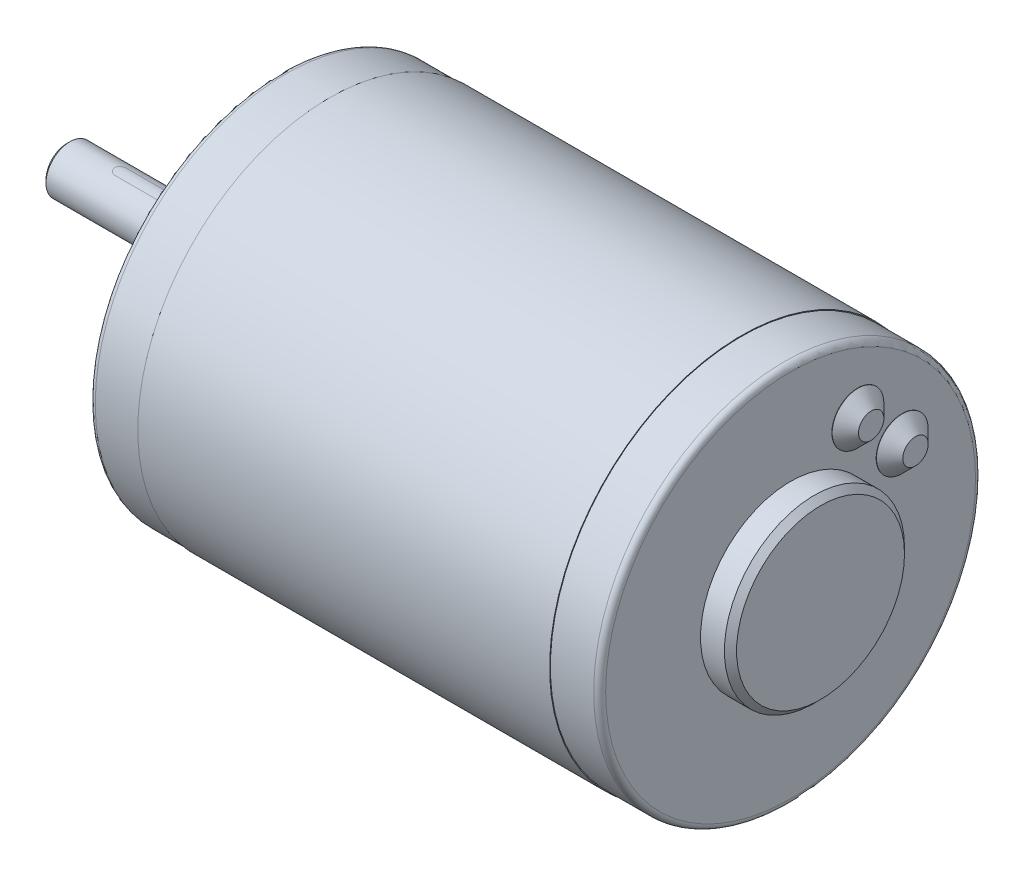
ISO-10303-21;
HEADER;
FILE_DESCRIPTION(('STEP AP214'),'2;1');
FILE_NAME('part.step','',(''),(''),'','','');
FILE_SCHEMA(('AUTOMOTIVE_DESIGN { 1 0 10303 214 1 1 1 1 }'));
ENDSEC;
DATA;
#1=APPLICATION_CONTEXT('core data for automotive mechanical design processes');
#2=APPLICATION_PROTOCOL_DEFINITION('international standard','automotive_design',2000,#1);
#3=PRODUCT_CONTEXT('',#1,'mechanical');
#4=PRODUCT('Part','Part','',(#3));
#5=PRODUCT_RELATED_PRODUCT_CATEGORY('part','',(#4));
#6=PRODUCT_DEFINITION_FORMATION('','',#4);
#7=PRODUCT_DEFINITION_CONTEXT('part definition',#1,'design');
#8=PRODUCT_DEFINITION('design','',#6,#7);
#9=PRODUCT_DEFINITION_SHAPE('','',#8);
#10=(LENGTH_UNIT() NAMED_UNIT(*) SI_UNIT(.MILLI.,.METRE.));
#11=(NAMED_UNIT(*) PLANE_ANGLE_UNIT() SI_UNIT($,.RADIAN.));
#12=(NAMED_UNIT(*) SI_UNIT($,.STERADIAN.) SOLID_ANGLE_UNIT());
#13=UNCERTAINTY_MEASURE_WITH_UNIT(LENGTH_MEASURE(1.E-05),#10,'distance_accuracy_value','');
#14=(GEOMETRIC_REPRESENTATION_CONTEXT(3) GLOBAL_UNCERTAINTY_ASSIGNED_CONTEXT((#13)) GLOBAL_UNIT_ASSIGNED_CONTEXT((#10,
#11,#12)) REPRESENTATION_CONTEXT('',''));
#15=CARTESIAN_POINT('',(0.,0.,0.));
#16=DIRECTION('',(0.,0.,1.));
#17=DIRECTION('',(1.,0.,0.));
#18=AXIS2_PLACEMENT_3D('',#15,#16,#17);
#19=CARTESIAN_POINT('',(-4.,0.,0.));
#20=DIRECTION('',(-1.,0.,0.));
#21=DIRECTION('',(0.,0.,1.));
#22=AXIS2_PLACEMENT_3D('',#19,#20,#21);
#23=PLANE('',#22);
#24=CARTESIAN_POINT('',(-4.,0.,0.));
#25=DIRECTION('',(-1.,0.,0.));
#26=DIRECTION('',(0.,0.,1.));
#27=AXIS2_PLACEMENT_3D('',#24,#25,#26);
#28=CIRCLE('',#27,8.50900000000003);
#29=CARTESIAN_POINT('',(-4.,0.,8.50900000000003));
#30=VERTEX_POINT('',#29);
#31=EDGE_CURVE('P0_E189',#30,#30,#28,.T.);
#32=ORIENTED_EDGE('',*,*,#31,.T.);
#33=EDGE_LOOP('',(#32));
#34=FACE_BOUND('',#33,.T.);
#35=CARTESIAN_POINT('',(-4.,0.,0.));
#36=DIRECTION('',(-1.,0.,0.));
#37=DIRECTION('',(0.,0.,1.));
#38=AXIS2_PLACEMENT_3D('',#35,#36,#37);
#39=CIRCLE('',#38,4.);
#40=CARTESIAN_POINT('',(-4.,0.,4.));
#41=VERTEX_POINT('',#40);
#42=EDGE_CURVE('P0_E121',#41,#41,#39,.T.);
#43=ORIENTED_EDGE('',*,*,#42,.F.);
#44=EDGE_LOOP('',(#43));
#45=FACE_BOUND('',#44,.T.);
#46=ADVANCED_FACE('P0_F38',(#34,#45),#23,.T.);
#47=CARTESIAN_POINT('',(0.,0.,0.));
#48=DIRECTION('',(-1.,0.,0.));
#49=DIRECTION('',(0.,0.,1.));
#50=AXIS2_PLACEMENT_3D('',#47,#48,#49);
#51=PLANE('',#50);
#52=CARTESIAN_POINT('',(0.,0.,0.));
#53=DIRECTION('',(-1.,0.,0.));
#54=DIRECTION('',(0.,0.,1.));
#55=AXIS2_PLACEMENT_3D('',#52,#53,#54);
#56=CIRCLE('',#55,30.877);
#57=CARTESIAN_POINT('',(0.,0.,30.877));
#58=VERTEX_POINT('',#57);
#59=EDGE_CURVE('P0_E207',#58,#58,#56,.T.);
#60=ORIENTED_EDGE('',*,*,#59,.T.);
#61=EDGE_LOOP('',(#60));
#62=FACE_BOUND('',#61,.T.);
#63=CARTESIAN_POINT('',(0.,25.4,0.));
#64=DIRECTION('',(-1.,0.,0.));
#65=DIRECTION('',(0.,0.,1.));
#66=AXIS2_PLACEMENT_3D('',#63,#64,#65);
#67=CIRCLE('',#66,2.01929999999999);
#68=CARTESIAN_POINT('',(0.,25.4,2.01929999999999));
#69=VERTEX_POINT('',#68);
#70=EDGE_CURVE('P0_E95',#69,#69,#67,.T.);
#71=ORIENTED_EDGE('',*,*,#70,.F.);
#72=EDGE_LOOP('',(#71));
#73=FACE_BOUND('',#72,.T.);
#74=CARTESIAN_POINT('',(0.,-25.4,0.));
#75=DIRECTION('',(-1.,0.,0.));
#76=DIRECTION('',(0.,0.,1.));
#77=AXIS2_PLACEMENT_3D('',#74,#75,#76);
#78=CIRCLE('',#77,2.01929999999999);
#79=CARTESIAN_POINT('',(0.,-25.4,2.01929999999999));
#80=VERTEX_POINT('',#79);
#81=EDGE_CURVE('P0_E94',#80,#80,#78,.T.);
#82=ORIENTED_EDGE('',*,*,#81,.F.);
#83=EDGE_LOOP('',(#82));
#84=FACE_BOUND('',#83,.T.);
#85=CARTESIAN_POINT('',(0.,0.,0.));
#86=DIRECTION('',(-1.,0.,0.));
#87=DIRECTION('',(0.,0.,1.));
#88=AXIS2_PLACEMENT_3D('',#85,#86,#87);
#89=CIRCLE('',#88,9.525);
#90=CARTESIAN_POINT('',(0.,0.,9.525));
#91=VERTEX_POINT('',#90);
#92=EDGE_CURVE('P0_E165',#91,#91,#89,.T.);
#93=ORIENTED_EDGE('',*,*,#92,.F.);
#94=EDGE_LOOP('',(#93));
#95=FACE_BOUND('',#94,.T.);
#96=ADVANCED_FACE('P0_F228',(#62,#73,#84,#95),#51,.T.);
#97=CARTESIAN_POINT('',(8.2296,32.004,0.));
#98=DIRECTION('',(-1.,0.,0.));
#99=DIRECTION('',(0.,0.,1.));
#100=AXIS2_PLACEMENT_3D('',#97,#98,#99);
#101=PLANE('',#100);
#102=CARTESIAN_POINT('',(8.2296,0.,0.));
#103=DIRECTION('',(1.,0.,0.));
#104=DIRECTION('',(0.,0.,-1.));
#105=AXIS2_PLACEMENT_3D('',#102,#103,#104);
#106=CIRCLE('',#105,32.004);
#107=CARTESIAN_POINT('',(8.2296,0.,-32.004));
#108=VERTEX_POINT('',#107);
#109=EDGE_CURVE('P0_E180',#108,#108,#106,.T.);
#110=ORIENTED_EDGE('',*,*,#109,.F.);
#111=EDGE_LOOP('',(#110));
#112=FACE_BOUND('',#111,.T.);
#113=CARTESIAN_POINT('',(8.2296,0.,0.));
#114=DIRECTION('',(-1.,0.,0.));
#115=DIRECTION('',(0.,0.,1.));
#116=AXIS2_PLACEMENT_3D('',#113,#114,#115);
#117=CIRCLE('',#116,31.877);
#118=CARTESIAN_POINT('',(8.2296,0.,31.877));
#119=VERTEX_POINT('',#118);
#120=EDGE_CURVE('P0_E168',#119,#119,#117,.T.);
#121=ORIENTED_EDGE('',*,*,#120,.F.);
#122=EDGE_LOOP('',(#121));
#123=FACE_BOUND('',#122,.T.);
#124=ADVANCED_FACE('P0_F234',(#112,#123),#101,.T.);
#125=CARTESIAN_POINT('',(85.216,0.,0.));
#126=DIRECTION('',(1.,0.,0.));
#127=DIRECTION('',(0.,0.,-1.));
#128=AXIS2_PLACEMENT_3D('',#125,#126,#127);
#129=PLANE('',#128);
#130=CARTESIAN_POINT('',(85.216,0.,0.));
#131=DIRECTION('',(1.,0.,0.));
#132=DIRECTION('',(0.,0.,-1.));
#133=AXIS2_PLACEMENT_3D('',#130,#131,#132);
#134=CIRCLE('',#133,30.877);
#135=CARTESIAN_POINT('',(85.216,0.,-30.877));
#136=VERTEX_POINT('',#135);
#137=EDGE_CURVE('P0_E46',#136,#136,#134,.T.);
#138=ORIENTED_EDGE('',*,*,#137,.T.);
#139=EDGE_LOOP('',(#138));
#140=FACE_BOUND('',#139,.T.);
#141=CARTESIAN_POINT('',(85.216,18.6070906828553,-11.2073596390943));
#142=DIRECTION('',(1.,0.,0.));
#143=DIRECTION('',(0.,0.,-1.));
#144=AXIS2_PLACEMENT_3D('',#141,#142,#143);
#145=CIRCLE('',#144,4.318);
#146=CARTESIAN_POINT('',(85.216,18.6070906828553,-15.5253596390943));
#147=VERTEX_POINT('',#146);
#148=EDGE_CURVE('P0_E186',#147,#147,#145,.T.);
#149=ORIENTED_EDGE('',*,*,#148,.F.);
#150=EDGE_LOOP('',(#149));
#151=FACE_BOUND('',#150,.T.);
#152=CARTESIAN_POINT('',(85.216,11.2073596390943,-18.6070906828553));
#153=DIRECTION('',(1.,0.,0.));
#154=DIRECTION('',(0.,0.,-1.));
#155=AXIS2_PLACEMENT_3D('',#152,#153,#154);
#156=CIRCLE('',#155,4.318);
#157=CARTESIAN_POINT('',(85.216,11.2073596390943,-22.9250906828553));
#158=VERTEX_POINT('',#157);
#159=EDGE_CURVE('P0_E183',#158,#158,#156,.T.);
#160=ORIENTED_EDGE('',*,*,#159,.F.);
#161=EDGE_LOOP('',(#160));
#162=FACE_BOUND('',#161,.T.);
#163=CARTESIAN_POINT('',(85.216,0.,0.));
#164=DIRECTION('',(1.,0.,0.));
#165=DIRECTION('',(0.,0.,-1.));
#166=AXIS2_PLACEMENT_3D('',#163,#164,#165);
#167=CIRCLE('',#166,15.0368);
#168=CARTESIAN_POINT('',(85.216,0.,-15.0368));
#169=VERTEX_POINT('',#168);
#170=EDGE_CURVE('P0_E171',#169,#169,#167,.T.);
#171=ORIENTED_EDGE('',*,*,#170,.F.);
#172=EDGE_LOOP('',(#171));
#173=FACE_BOUND('',#172,.T.);
#174=ADVANCED_FACE('P0_F215',(#140,#151,#162,#173),#129,.T.);
#175=CARTESIAN_POINT('',(76.9864,0.,0.));
#176=DIRECTION('',(1.,0.,0.));
#177=DIRECTION('',(0.,0.,-1.));
#178=AXIS2_PLACEMENT_3D('',#175,#176,#177);
#179=PLANE('',#178);
#180=CARTESIAN_POINT('',(76.9864,0.,0.));
#181=DIRECTION('',(1.,0.,0.));
#182=DIRECTION('',(0.,0.,-1.));
#183=AXIS2_PLACEMENT_3D('',#180,#181,#182);
#184=CIRCLE('',#183,32.004);
#185=CARTESIAN_POINT('',(76.9864,0.,-32.004));
#186=VERTEX_POINT('',#185);
#187=EDGE_CURVE('P0_E177',#186,#186,#184,.T.);
#188=ORIENTED_EDGE('',*,*,#187,.T.);
#189=EDGE_LOOP('',(#188));
#190=FACE_BOUND('',#189,.T.);
#191=CARTESIAN_POINT('',(76.9864,0.,0.));
#192=DIRECTION('',(1.,0.,0.));
#193=DIRECTION('',(0.,0.,-1.));
#194=AXIS2_PLACEMENT_3D('',#191,#192,#193);
#195=CIRCLE('',#194,31.877);
#196=CARTESIAN_POINT('',(76.9864,0.,-31.877));
#197=VERTEX_POINT('',#196);
#198=EDGE_CURVE('P0_E174',#197,#197,#195,.T.);
#199=ORIENTED_EDGE('',*,*,#198,.F.);
#200=EDGE_LOOP('',(#199));
#201=FACE_BOUND('',#200,.T.);
#202=ADVANCED_FACE('P0_F261',(#190,#201),#179,.T.);
#203=CARTESIAN_POINT('',(8.2296,0.,0.));
#204=DIRECTION('',(1.,0.,0.));
#205=DIRECTION('',(0.,0.,-1.));
#206=AXIS2_PLACEMENT_3D('',#203,#204,#205);
#207=CYLINDRICAL_SURFACE('',#206,32.004);
#208=ORIENTED_EDGE('',*,*,#109,.T.);
#209=EDGE_LOOP('',(#208));
#210=FACE_BOUND('',#209,.T.);
#211=ORIENTED_EDGE('',*,*,#187,.F.);
#212=EDGE_LOOP('',(#211));
#213=FACE_BOUND('',#212,.T.);
#214=ADVANCED_FACE('P0_F264',(#210,#213),#207,.T.);
#215=CARTESIAN_POINT('',(85.216,0.,0.));
#216=DIRECTION('',(-1.,0.,0.));
#217=DIRECTION('',(0.,0.,1.));
#218=AXIS2_PLACEMENT_3D('',#215,#216,#217);
#219=CYLINDRICAL_SURFACE('',#218,31.877);
#220=CARTESIAN_POINT('',(84.216,0.,0.));
#221=DIRECTION('',(1.,0.,0.));
#222=DIRECTION('',(0.,0.,-1.));
#223=AXIS2_PLACEMENT_3D('',#220,#221,#222);
#224=CIRCLE('',#223,31.877);
#225=CARTESIAN_POINT('',(84.216,0.,-31.877));
#226=VERTEX_POINT('',#225);
#227=EDGE_CURVE('P0_E11',#226,#226,#224,.F.);
#228=ORIENTED_EDGE('',*,*,#227,.T.);
#229=EDGE_LOOP('',(#228));
#230=FACE_BOUND('',#229,.T.);
#231=ORIENTED_EDGE('',*,*,#198,.T.);
#232=EDGE_LOOP('',(#231));
#233=FACE_BOUND('',#232,.T.);
#234=ADVANCED_FACE('P0_F257',(#230,#233),#219,.T.);
#235=CARTESIAN_POINT('',(90.216,0.,0.));
#236=DIRECTION('',(-1.,0.,0.));
#237=DIRECTION('',(0.,0.,1.));
#238=AXIS2_PLACEMENT_3D('',#235,#236,#237);
#239=CYLINDRICAL_SURFACE('',#238,15.0368);
#240=CARTESIAN_POINT('',(89.2,0.,0.));
#241=DIRECTION('',(1.,0.,0.));
#242=DIRECTION('',(0.,0.,-1.));
#243=AXIS2_PLACEMENT_3D('',#240,#241,#242);
#244=CIRCLE('',#243,15.0368);
#245=CARTESIAN_POINT('',(89.2,0.,-15.0368));
#246=VERTEX_POINT('',#245);
#247=EDGE_CURVE('P0_E198',#246,#246,#244,.F.);
#248=ORIENTED_EDGE('',*,*,#247,.T.);
#249=EDGE_LOOP('',(#248));
#250=FACE_BOUND('',#249,.T.);
#251=ORIENTED_EDGE('',*,*,#170,.T.);
#252=EDGE_LOOP('',(#251));
#253=FACE_BOUND('',#252,.T.);
#254=ADVANCED_FACE('P0_F253',(#250,#253),#239,.T.);
#255=CARTESIAN_POINT('',(90.216,0.,0.));
#256=DIRECTION('',(1.,0.,0.));
#257=DIRECTION('',(0.,0.,-1.));
#258=AXIS2_PLACEMENT_3D('',#255,#256,#257);
#259=PLANE('',#258);
#260=CARTESIAN_POINT('',(90.216,0.,0.));
#261=DIRECTION('',(1.,0.,0.));
#262=DIRECTION('',(0.,0.,-1.));
#263=AXIS2_PLACEMENT_3D('',#260,#261,#262);
#264=CIRCLE('',#263,14.0208);
#265=CARTESIAN_POINT('',(90.216,0.,-14.0208));
#266=VERTEX_POINT('',#265);
#267=EDGE_CURVE('P0_E195',#266,#266,#264,.T.);
#268=ORIENTED_EDGE('',*,*,#267,.T.);
#269=EDGE_LOOP('',(#268));
#270=FACE_BOUND('',#269,.T.);
#271=ADVANCED_FACE('P0_F249',(#270),#259,.T.);
#272=CARTESIAN_POINT('',(0.,0.,0.));
#273=DIRECTION('',(1.,0.,0.));
#274=DIRECTION('',(0.,0.,-1.));
#275=AXIS2_PLACEMENT_3D('',#272,#273,#274);
#276=CYLINDRICAL_SURFACE('',#275,31.877);
#277=CARTESIAN_POINT('',(0.999999999999997,0.,0.));
#278=DIRECTION('',(-1.,0.,0.));
#279=DIRECTION('',(0.,0.,1.));
#280=AXIS2_PLACEMENT_3D('',#277,#278,#279);
#281=CIRCLE('',#280,31.877);
#282=CARTESIAN_POINT('',(0.999999999999997,0.,31.877));
#283=VERTEX_POINT('',#282);
#284=EDGE_CURVE('P0_E210',#283,#283,#281,.F.);
#285=ORIENTED_EDGE('',*,*,#284,.T.);
#286=EDGE_LOOP('',(#285));
#287=FACE_BOUND('',#286,.T.);
#288=ORIENTED_EDGE('',*,*,#120,.T.);
#289=EDGE_LOOP('',(#288));
#290=FACE_BOUND('',#289,.T.);
#291=ADVANCED_FACE('P0_F244',(#287,#290),#276,.T.);
#292=CARTESIAN_POINT('',(-4.,0.,0.));
#293=DIRECTION('',(1.,0.,0.));
#294=DIRECTION('',(0.,0.,-1.));
#295=AXIS2_PLACEMENT_3D('',#292,#293,#294);
#296=CYLINDRICAL_SURFACE('',#295,9.525);
#297=CARTESIAN_POINT('',(-2.98400000000003,0.,0.));
#298=DIRECTION('',(-1.,0.,0.));
#299=DIRECTION('',(0.,0.,1.));
#300=AXIS2_PLACEMENT_3D('',#297,#298,#299);
#301=CIRCLE('',#300,9.525);
#302=CARTESIAN_POINT('',(-2.98400000000003,0.,9.525));
#303=VERTEX_POINT('',#302);
#304=EDGE_CURVE('P0_E192',#303,#303,#301,.F.);
#305=ORIENTED_EDGE('',*,*,#304,.T.);
#306=EDGE_LOOP('',(#305));
#307=FACE_BOUND('',#306,.T.);
#308=ORIENTED_EDGE('',*,*,#92,.T.);
#309=EDGE_LOOP('',(#308));
#310=FACE_BOUND('',#309,.T.);
#311=ADVANCED_FACE('P0_F242',(#307,#310),#296,.T.);
#312=CARTESIAN_POINT('',(-35.6,0.,0.));
#313=DIRECTION('',(1.,0.,0.));
#314=DIRECTION('',(0.,0.,-1.));
#315=AXIS2_PLACEMENT_3D('',#312,#313,#314);
#316=CYLINDRICAL_SURFACE('',#315,4.);
#317=CARTESIAN_POINT('',(-35.0999999999929,0.,0.));
#318=DIRECTION('',(-1.,0.,0.));
#319=DIRECTION('',(0.,0.,1.));
#320=AXIS2_PLACEMENT_3D('',#317,#318,#319);
#321=CIRCLE('',#320,4.);
#322=CARTESIAN_POINT('',(-35.0999999999929,0.,4.));
#323=VERTEX_POINT('',#322);
#324=EDGE_CURVE('P0_E204',#323,#323,#321,.F.);
#325=ORIENTED_EDGE('',*,*,#324,.T.);
#326=EDGE_LOOP('',(#325));
#327=FACE_BOUND('',#326,.T.);
#328=DIRECTION('',(1.,0.,0.));
#329=VECTOR('',#328,1.);
#330=CARTESIAN_POINT('',(0.,3.87298334620741,-1.));
#331=LINE('',#330,#329);
#332=CARTESIAN_POINT('',(-26.6,3.87298334620741,-1.));
#333=VERTEX_POINT('',#332);
#334=CARTESIAN_POINT('',(-7.1,3.87298334620741,-1.));
#335=VERTEX_POINT('',#334);
#336=EDGE_CURVE('P0_E140',#333,#335,#331,.T.);
#337=ORIENTED_EDGE('',*,*,#336,.T.);
#338=CARTESIAN_POINT('',(-7.1,3.87298334620741,-1.));
#339=CARTESIAN_POINT('',(-7.07233701489346,3.87298148580177,-1.00000033749611));
#340=CARTESIAN_POINT('',(-7.04468773698177,3.8732800994947,-0.998851407375366));
#341=CARTESIAN_POINT('',(-6.98959596469644,3.87445904774558,-0.994271295395754));
#342=CARTESIAN_POINT('',(-6.96215343631291,3.87533928441687,-0.990840497572679));
#343=CARTESIAN_POINT('',(-6.88054682679116,3.87881710972053,-0.977175239382526));
#344=CARTESIAN_POINT('',(-6.82694353151779,3.88225203148808,-0.963567695172493));
#345=CARTESIAN_POINT('',(-6.72287532621804,3.89095422588002,-0.927798076247997));
#346=CARTESIAN_POINT('',(-6.67241012178714,3.89622132630929,-0.905636805423836));
#347=CARTESIAN_POINT('',(-6.57588855135267,3.90799134471939,-0.853415378025865));
#348=CARTESIAN_POINT('',(-6.52983337210904,3.91449459395647,-0.823353103356933));
#349=CARTESIAN_POINT('',(-6.4424561180939,3.92816262398025,-0.755484471828069));
#350=CARTESIAN_POINT('',(-6.40124511375448,3.93533791028915,-0.717537268783976));
#351=CARTESIAN_POINT('',(-6.32569791051729,3.94945104396193,-0.63527578051623));
#352=CARTESIAN_POINT('',(-6.29136281053206,3.95638885322537,-0.590960479478831));
#353=CARTESIAN_POINT('',(-6.23008899838136,3.96936182283248,-0.496456899401691));
#354=CARTESIAN_POINT('',(-6.20326010401603,3.9753830468173,-0.446195340334474));
#355=CARTESIAN_POINT('',(-6.1584752658033,3.98572346250588,-0.341702590842919));
#356=CARTESIAN_POINT('',(-6.14051757570017,3.990042989147,-0.28747218408301));
#357=CARTESIAN_POINT('',(-6.11434100722257,3.99641900005128,-0.17774410852516));
#358=CARTESIAN_POINT('',(-6.10593232757718,3.998519529013,-0.122294322002858));
#359=CARTESIAN_POINT('',(-6.09849662845671,4.00037438150815,-0.0107327756816796));
#360=CARTESIAN_POINT('',(-6.09946842980766,4.00012899993444,0.0453789000287057));
#361=CARTESIAN_POINT('',(-6.11062996368545,3.99735237365735,0.155352492972096));
#362=CARTESIAN_POINT('',(-6.12061461659948,3.9948719867736,0.209236701739855));
#363=CARTESIAN_POINT('',(-6.14918867918275,3.98796330636495,0.31453871108434));
#364=CARTESIAN_POINT('',(-6.16777846956858,3.98353492665556,0.365956402423988));
#365=CARTESIAN_POINT('',(-6.21320128067065,3.97314997761798,0.465407286024539));
#366=CARTESIAN_POINT('',(-6.24010739423284,3.96717993827555,0.513405629602248));
#367=CARTESIAN_POINT('',(-6.30134312983347,3.95435945541919,0.604276631230014));
#368=CARTESIAN_POINT('',(-6.33567387025322,3.94750887933198,0.647148515562289));
#369=CARTESIAN_POINT('',(-6.41187891208131,3.93345566022865,0.72776938970849));
#370=CARTESIAN_POINT('',(-6.45393163653981,3.92624850477685,0.765349103054127));
#371=CARTESIAN_POINT('',(-6.54382986692773,3.91246168284006,0.832969575186237));
#372=CARTESIAN_POINT('',(-6.59167695328356,3.90588218842993,0.863008270245062));
#373=CARTESIAN_POINT('',(-6.69214559782377,3.89407813586325,0.914804709285962));
#374=CARTESIAN_POINT('',(-6.74479146489609,3.88886106009136,0.936517017887269));
#375=CARTESIAN_POINT('',(-6.85311692841829,3.88047058807055,0.970702351849829));
#376=CARTESIAN_POINT('',(-6.90879185514984,3.87729413761435,0.983189189212132));
#377=CARTESIAN_POINT('',(-6.9874573807589,3.87455290681524,0.993904635150938));
#378=CARTESIAN_POINT('',(-7.00991970321318,3.87396523110859,0.996190790966708));
#379=CARTESIAN_POINT('',(-7.05491778990932,3.87318062488974,0.999236757697394));
#380=CARTESIAN_POINT('',(-7.07745337595529,3.87298306219461,0.999999038096045));
#381=CARTESIAN_POINT('',(-7.1,3.87298334620741,1.));
#382=B_SPLINE_CURVE_WITH_KNOTS('',3,(#338,#339,#340,#341,#342,#343,#344,#345,#346,#347,#348,
#349,#350,#351,#352,#353,#354,#355,#356,#357,#358,#359,#360,#361,#362,#363,#364,#365,#366,#367,
#368,#369,#370,#371,#372,#373,#374,#375,#376,#377,#378,#379,#380,#381),.UNSPECIFIED.,.F.,.F.,(4,
2,2,2,2,2,2,2,2,2,2,2,2,2,2,2,2,2,2,2,2,4),(0.,0.0829365303397693,0.165859106084651,
0.331229963080317,0.496585282091498,0.661984974726749,0.830641897427974,0.999325753539193,
1.17036187098235,1.34136430732424,1.50890481515325,1.67642426256639,1.84022545479276,
2.00403389475838,2.16932509450376,2.33464120964329,2.50441429534542,2.67423379180967,
2.84496720161068,3.01544447539986,3.08315848722648,3.15076267731671),.UNSPECIFIED.);
#383=CARTESIAN_POINT('',(-7.1,3.87298334620741,1.));
#384=VERTEX_POINT('',#383);
#385=EDGE_CURVE('P0_E117',#335,#384,#382,.T.);
#386=ORIENTED_EDGE('',*,*,#385,.T.);
#387=DIRECTION('',(1.,0.,0.));
#388=VECTOR('',#387,1.);
#389=CARTESIAN_POINT('',(0.,3.87298334620741,1.));
#390=LINE('',#389,#388);
#391=CARTESIAN_POINT('',(-26.6,3.87298334620741,1.));
#392=VERTEX_POINT('',#391);
#393=EDGE_CURVE('P0_E155',#384,#392,#390,.F.);
#394=ORIENTED_EDGE('',*,*,#393,.T.);
#395=CARTESIAN_POINT('',(-26.6,3.87298334620741,1.));
#396=CARTESIAN_POINT('',(-26.6276629851065,3.87298148580177,1.00000033749611));
#397=CARTESIAN_POINT('',(-26.6553122630182,3.8732800994947,0.998851407375366));
#398=CARTESIAN_POINT('',(-26.7104040353036,3.87445904774558,0.994271295395754));
#399=CARTESIAN_POINT('',(-26.7378465636871,3.87533928441687,0.990840497572679));
#400=CARTESIAN_POINT('',(-26.8194531732088,3.87881710972053,0.977175239382526));
#401=CARTESIAN_POINT('',(-26.8730564684822,3.88225203148808,0.963567695172493));
#402=CARTESIAN_POINT('',(-26.977124673782,3.89095422588002,0.927798076247996));
#403=CARTESIAN_POINT('',(-27.0275898782129,3.89622132630929,0.905636805423835));
#404=CARTESIAN_POINT('',(-27.1241114486473,3.90799134471939,0.853415378025864));
#405=CARTESIAN_POINT('',(-27.170166627891,3.91449459395647,0.823353103356932));
#406=CARTESIAN_POINT('',(-27.2575438819061,3.92816262398025,0.755484471828069));
#407=CARTESIAN_POINT('',(-27.2987548862455,3.93533791028915,0.717537268783975));
#408=CARTESIAN_POINT('',(-27.3743020894827,3.94945104396193,0.635275780516229));
#409=CARTESIAN_POINT('',(-27.4086371894679,3.95638885322537,0.59096047947883));
#410=CARTESIAN_POINT('',(-27.4699110016186,3.96936182283248,0.496456899401689));
#411=CARTESIAN_POINT('',(-27.496739895984,3.9753830468173,0.446195340334472));
#412=CARTESIAN_POINT('',(-27.5415247341967,3.98572346250588,0.341702590842916));
#413=CARTESIAN_POINT('',(-27.5594824242998,3.990042989147,0.287472184083007));
#414=CARTESIAN_POINT('',(-27.5856589927774,3.99641900005128,0.177744108525158));
#415=CARTESIAN_POINT('',(-27.5940676724228,3.998519529013,0.122294322002856));
#416=CARTESIAN_POINT('',(-27.6015033715433,4.00037438150815,0.0107327756816781));
#417=CARTESIAN_POINT('',(-27.6005315701923,4.00012899993444,-0.0453789000287067));
#418=CARTESIAN_POINT('',(-27.5893700363146,3.99735237365735,-0.155352492972096));
#419=CARTESIAN_POINT('',(-27.5793853834005,3.9948719867736,-0.209236701739855));
#420=CARTESIAN_POINT('',(-27.5508113208173,3.98796330636495,-0.31453871108434));
#421=CARTESIAN_POINT('',(-27.5322215304314,3.98353492665556,-0.365956402423988));
#422=CARTESIAN_POINT('',(-27.4867987193294,3.97314997761798,-0.46540728602454));
#423=CARTESIAN_POINT('',(-27.4598926057672,3.96717993827555,-0.513405629602248));
#424=CARTESIAN_POINT('',(-27.3986568701665,3.95435945541919,-0.604276631230015));
#425=CARTESIAN_POINT('',(-27.3643261297468,3.94750887933198,-0.64714851556229));
#426=CARTESIAN_POINT('',(-27.2881210879187,3.93345566022865,-0.727769389708492));
#427=CARTESIAN_POINT('',(-27.2460683634602,3.92624850477685,-0.765349103054128));
#428=CARTESIAN_POINT('',(-27.1561701330723,3.91246168284006,-0.832969575186237));
#429=CARTESIAN_POINT('',(-27.1083230467164,3.90588218842993,-0.863008270245062));
#430=CARTESIAN_POINT('',(-27.0078544021762,3.89407813586325,-0.914804709285961));
#431=CARTESIAN_POINT('',(-26.9552085351039,3.88886106009136,-0.936517017887269));
#432=CARTESIAN_POINT('',(-26.8468830715817,3.88047058807054,-0.970702351849828));
#433=CARTESIAN_POINT('',(-26.7912081448502,3.87729413761435,-0.983189189212131));
#434=CARTESIAN_POINT('',(-26.7125426192411,3.87455290681524,-0.993904635150938));
#435=CARTESIAN_POINT('',(-26.6900802967868,3.87396523110859,-0.996190790966708));
#436=CARTESIAN_POINT('',(-26.6450822100907,3.87318062488974,-0.999236757697394));
#437=CARTESIAN_POINT('',(-26.6225466240447,3.87298306219461,-0.999999038096045));
#438=CARTESIAN_POINT('',(-26.6,3.87298334620741,-1.));
#439=B_SPLINE_CURVE_WITH_KNOTS('',3,(#395,#396,#397,#398,#399,#400,#401,#402,#403,#404,#405,
#406,#407,#408,#409,#410,#411,#412,#413,#414,#415,#416,#417,#418,#419,#420,#421,#422,#423,#424,
#425,#426,#427,#428,#429,#430,#431,#432,#433,#434,#435,#436,#437,#438),.UNSPECIFIED.,.F.,.F.,(4,
2,2,2,2,2,2,2,2,2,2,2,2,2,2,2,2,2,2,2,2,4),(0.,0.0829365303397727,0.165859106084653,
0.331229963080318,0.496585282091499,0.661984974726751,0.830641897427976,0.999325753539196,
1.17036187098235,1.34136430732425,1.50890481515325,1.67642426256639,1.84022545479276,
2.00403389475838,2.16932509450376,2.33464120964329,2.50441429534542,2.67423379180967,
2.84496720161068,3.01544447539986,3.08315848722649,3.15076267731671),.UNSPECIFIED.);
#440=EDGE_CURVE('P0_E53',#392,#333,#439,.T.);
#441=ORIENTED_EDGE('',*,*,#440,.T.);
#442=EDGE_LOOP('',(#337,#386,#394,#441));
#443=FACE_BOUND('',#442,.T.);
#444=ORIENTED_EDGE('',*,*,#42,.T.);
#445=EDGE_LOOP('',(#444));
#446=FACE_BOUND('',#445,.T.);
#447=ADVANCED_FACE('P0_F240',(#327,#443,#446),#316,.T.);
#448=CARTESIAN_POINT('',(-35.6,0.,0.));
#449=DIRECTION('',(-1.,0.,0.));
#450=DIRECTION('',(0.,0.,1.));
#451=AXIS2_PLACEMENT_3D('',#448,#449,#450);
#452=PLANE('',#451);
#453=CARTESIAN_POINT('',(-35.6,0.,0.));
#454=DIRECTION('',(-1.,0.,0.));
#455=DIRECTION('',(0.,0.,1.));
#456=AXIS2_PLACEMENT_3D('',#453,#454,#455);
#457=CIRCLE('',#456,3.4999999999361);
#458=CARTESIAN_POINT('',(-35.6,0.,3.4999999999361));
#459=VERTEX_POINT('',#458);
#460=EDGE_CURVE('P0_E201',#459,#459,#457,.T.);
#461=ORIENTED_EDGE('',*,*,#460,.T.);
#462=EDGE_LOOP('',(#461));
#463=FACE_BOUND('',#462,.T.);
#464=ADVANCED_FACE('P0_F291',(#463),#452,.T.);
#465=CARTESIAN_POINT('',(-7.1,32.005,0.));
#466=DIRECTION('',(0.,-1.,0.));
#467=DIRECTION('',(0.,0.,-1.));
#468=AXIS2_PLACEMENT_3D('',#465,#466,#467);
#469=CYLINDRICAL_SURFACE('',#468,1.);
#470=ORIENTED_EDGE('',*,*,#385,.F.);
#471=DIRECTION('',(0.,-1.,0.));
#472=VECTOR('',#471,1.);
#473=CARTESIAN_POINT('',(-7.1,32.005,-1.));
#474=LINE('',#473,#472);
#475=CARTESIAN_POINT('',(-7.1,2.79999999999999,-1.));
#476=VERTEX_POINT('',#475);
#477=EDGE_CURVE('P0_E139',#335,#476,#474,.T.);
#478=ORIENTED_EDGE('',*,*,#477,.T.);
#479=CARTESIAN_POINT('',(-7.1,2.79999999999999,0.));
#480=DIRECTION('',(0.,-1.,0.));
#481=DIRECTION('',(0.,0.,-1.));
#482=AXIS2_PLACEMENT_3D('',#479,#480,#481);
#483=CIRCLE('',#482,1.);
#484=CARTESIAN_POINT('',(-7.1,2.79999999999999,1.));
#485=VERTEX_POINT('',#484);
#486=EDGE_CURVE('P0_E128',#476,#485,#483,.T.);
#487=ORIENTED_EDGE('',*,*,#486,.T.);
#488=DIRECTION('',(0.,-1.,0.));
#489=VECTOR('',#488,1.);
#490=CARTESIAN_POINT('',(-7.1,32.005,1.));
#491=LINE('',#490,#489);
#492=EDGE_CURVE('P0_E61',#384,#485,#491,.T.);
#493=ORIENTED_EDGE('',*,*,#492,.F.);
#494=EDGE_LOOP('',(#470,#478,#487,#493));
#495=FACE_BOUND('',#494,.T.);
#496=ADVANCED_FACE('P0_F293',(#495),#469,.F.);
#497=CARTESIAN_POINT('',(-26.6,32.005,-1.));
#498=DIRECTION('',(0.,0.,-1.));
#499=DIRECTION('',(-1.,0.,0.));
#500=AXIS2_PLACEMENT_3D('',#497,#498,#499);
#501=PLANE('',#500);
#502=ORIENTED_EDGE('',*,*,#336,.F.);
#503=DIRECTION('',(0.,-1.,0.));
#504=VECTOR('',#503,1.);
#505=CARTESIAN_POINT('',(-26.6,32.005,-1.));
#506=LINE('',#505,#504);
#507=CARTESIAN_POINT('',(-26.6,2.79999999999999,-1.));
#508=VERTEX_POINT('',#507);
#509=EDGE_CURVE('P0_E138',#333,#508,#506,.T.);
#510=ORIENTED_EDGE('',*,*,#509,.T.);
#511=DIRECTION('',(1.,0.,0.));
#512=VECTOR('',#511,1.);
#513=CARTESIAN_POINT('',(-26.6,2.79999999999999,-1.));
#514=LINE('',#513,#512);
#515=EDGE_CURVE('P0_E118',#508,#476,#514,.T.);
#516=ORIENTED_EDGE('',*,*,#515,.T.);
#517=ORIENTED_EDGE('',*,*,#477,.F.);
#518=EDGE_LOOP('',(#502,#510,#516,#517));
#519=FACE_BOUND('',#518,.T.);
#520=ADVANCED_FACE('P0_F298',(#519),#501,.F.);
#521=CARTESIAN_POINT('',(-26.6,32.005,0.));
#522=DIRECTION('',(0.,-1.,0.));
#523=DIRECTION('',(0.,0.,-1.));
#524=AXIS2_PLACEMENT_3D('',#521,#522,#523);
#525=CYLINDRICAL_SURFACE('',#524,1.);
#526=ORIENTED_EDGE('',*,*,#440,.F.);
#527=DIRECTION('',(0.,-1.,0.));
#528=VECTOR('',#527,1.);
#529=CARTESIAN_POINT('',(-26.6,32.005,1.));
#530=LINE('',#529,#528);
#531=CARTESIAN_POINT('',(-26.6,2.79999999999999,1.));
#532=VERTEX_POINT('',#531);
#533=EDGE_CURVE('P0_E130',#392,#532,#530,.T.);
#534=ORIENTED_EDGE('',*,*,#533,.T.);
#535=CARTESIAN_POINT('',(-26.6,2.79999999999999,0.));
#536=DIRECTION('',(0.,-1.,0.));
#537=DIRECTION('',(0.,0.,-1.));
#538=AXIS2_PLACEMENT_3D('',#535,#536,#537);
#539=CIRCLE('',#538,1.);
#540=EDGE_CURVE('P0_E122',#532,#508,#539,.T.);
#541=ORIENTED_EDGE('',*,*,#540,.T.);
#542=ORIENTED_EDGE('',*,*,#509,.F.);
#543=EDGE_LOOP('',(#526,#534,#541,#542));
#544=FACE_BOUND('',#543,.T.);
#545=ADVANCED_FACE('P0_F304',(#544),#525,.F.);
#546=CARTESIAN_POINT('',(-7.1,32.005,1.));
#547=DIRECTION('',(0.,0.,1.));
#548=DIRECTION('',(1.,0.,0.));
#549=AXIS2_PLACEMENT_3D('',#546,#547,#548);
#550=PLANE('',#549);
#551=ORIENTED_EDGE('',*,*,#393,.F.);
#552=ORIENTED_EDGE('',*,*,#492,.T.);
#553=DIRECTION('',(-1.,0.,0.));
#554=VECTOR('',#553,1.);
#555=CARTESIAN_POINT('',(-7.1,2.79999999999999,1.));
#556=LINE('',#555,#554);
#557=EDGE_CURVE('P0_E125',#485,#532,#556,.T.);
#558=ORIENTED_EDGE('',*,*,#557,.T.);
#559=ORIENTED_EDGE('',*,*,#533,.F.);
#560=EDGE_LOOP('',(#551,#552,#558,#559));
#561=FACE_BOUND('',#560,.T.);
#562=ADVANCED_FACE('P0_F307',(#561),#550,.F.);
#563=CARTESIAN_POINT('',(-7.1,2.79999999999999,0.));
#564=DIRECTION('',(0.,-1.,0.));
#565=DIRECTION('',(0.,0.,-1.));
#566=AXIS2_PLACEMENT_3D('',#563,#564,#565);
#567=PLANE('',#566);
#568=ORIENTED_EDGE('',*,*,#486,.F.);
#569=ORIENTED_EDGE('',*,*,#515,.F.);
#570=ORIENTED_EDGE('',*,*,#540,.F.);
#571=ORIENTED_EDGE('',*,*,#557,.F.);
#572=EDGE_LOOP('',(#568,#569,#570,#571));
#573=FACE_BOUND('',#572,.T.);
#574=ADVANCED_FACE('P0_F309',(#573),#567,.F.);
#575=CARTESIAN_POINT('',(85.216,11.2073596390943,-18.6070906828553));
#576=DIRECTION('',(1.,0.,0.));
#577=DIRECTION('',(0.,0.,-1.));
#578=AXIS2_PLACEMENT_3D('',#575,#576,#577);
#579=CYLINDRICAL_SURFACE('',#578,4.318);
#580=ORIENTED_EDGE('',*,*,#159,.T.);
#581=EDGE_LOOP('',(#580));
#582=FACE_BOUND('',#581,.T.);
#583=CARTESIAN_POINT('',(85.2639,11.2073596390943,-18.6070906828553));
#584=DIRECTION('',(1.,0.,0.));
#585=DIRECTION('',(0.,0.,-1.));
#586=AXIS2_PLACEMENT_3D('',#583,#584,#585);
#587=CIRCLE('',#586,4.318);
#588=CARTESIAN_POINT('',(85.2639,11.2073596390943,-22.9250906828553));
#589=VERTEX_POINT('',#588);
#590=EDGE_CURVE('P0_E111',#589,#589,#587,.T.);
#591=ORIENTED_EDGE('',*,*,#590,.F.);
#592=EDGE_LOOP('',(#591));
#593=FACE_BOUND('',#592,.T.);
#594=ADVANCED_FACE('P0_F314',(#582,#593),#579,.T.);
#595=CARTESIAN_POINT('',(87.4638999999649,11.2073596390943,-18.6070906828553));
#596=DIRECTION('',(1.,0.,0.));
#597=DIRECTION('',(0.,0.,-1.));
#598=AXIS2_PLACEMENT_3D('',#595,#596,#597);
#599=PLANE('',#598);
#600=CARTESIAN_POINT('',(87.4638999999649,11.2073596390943,-18.6070906828553));
#601=DIRECTION('',(1.,0.,0.));
#602=DIRECTION('',(0.,0.,-1.));
#603=AXIS2_PLACEMENT_3D('',#600,#601,#602);
#604=CIRCLE('',#603,2.11800000003506);
#605=CARTESIAN_POINT('',(87.4638999999649,11.2073596390943,-20.7250906828904));
#606=VERTEX_POINT('',#605);
#607=EDGE_CURVE('P0_E114',#606,#606,#604,.T.);
#608=ORIENTED_EDGE('',*,*,#607,.T.);
#609=EDGE_LOOP('',(#608));
#610=FACE_BOUND('',#609,.T.);
#611=ADVANCED_FACE('P0_F337',(#610),#599,.T.);
#612=CARTESIAN_POINT('',(87.4638999999649,11.2073596390943,-18.6070906828553));
#613=DIRECTION('',(-1.,0.,0.));
#614=DIRECTION('',(0.,0.,1.));
#615=AXIS2_PLACEMENT_3D('',#612,#613,#614);
#616=CONICAL_SURFACE('',#615,2.11800000003506,0.78539816339745);
#617=ORIENTED_EDGE('',*,*,#590,.T.);
#618=EDGE_LOOP('',(#617));
#619=FACE_BOUND('',#618,.T.);
#620=ORIENTED_EDGE('',*,*,#607,.F.);
#621=EDGE_LOOP('',(#620));
#622=FACE_BOUND('',#621,.T.);
#623=ADVANCED_FACE('P0_F343',(#619,#622),#616,.T.);
#624=CARTESIAN_POINT('',(85.216,18.6070906828553,-11.2073596390943));
#625=DIRECTION('',(1.,0.,0.));
#626=DIRECTION('',(0.,0.,-1.));
#627=AXIS2_PLACEMENT_3D('',#624,#625,#626);
#628=CYLINDRICAL_SURFACE('',#627,4.318);
#629=ORIENTED_EDGE('',*,*,#148,.T.);
#630=EDGE_LOOP('',(#629));
#631=FACE_BOUND('',#630,.T.);
#632=CARTESIAN_POINT('',(85.2639,18.6070906828553,-11.2073596390943));
#633=DIRECTION('',(1.,0.,0.));
#634=DIRECTION('',(0.,0.,-1.));
#635=AXIS2_PLACEMENT_3D('',#632,#633,#634);
#636=CIRCLE('',#635,4.318);
#637=CARTESIAN_POINT('',(85.2639,18.6070906828553,-15.5253596390943));
#638=VERTEX_POINT('',#637);
#639=EDGE_CURVE('P0_E105',#638,#638,#636,.T.);
#640=ORIENTED_EDGE('',*,*,#639,.F.);
#641=EDGE_LOOP('',(#640));
#642=FACE_BOUND('',#641,.T.);
#643=ADVANCED_FACE('P0_F347',(#631,#642),#628,.T.);
#644=CARTESIAN_POINT('',(87.4638999999503,18.6070906828553,-11.2073596390943));
#645=DIRECTION('',(1.,0.,0.));
#646=DIRECTION('',(0.,0.,-1.));
#647=AXIS2_PLACEMENT_3D('',#644,#645,#646);
#648=PLANE('',#647);
#649=CARTESIAN_POINT('',(87.4638999999503,18.6070906828553,-11.2073596390943));
#650=DIRECTION('',(1.,0.,0.));
#651=DIRECTION('',(0.,0.,-1.));
#652=AXIS2_PLACEMENT_3D('',#649,#650,#651);
#653=CIRCLE('',#652,2.11800000004973);
#654=CARTESIAN_POINT('',(87.4638999999503,18.6070906828553,-13.3253596391441));
#655=VERTEX_POINT('',#654);
#656=EDGE_CURVE('P0_E108',#655,#655,#653,.T.);
#657=ORIENTED_EDGE('',*,*,#656,.T.);
#658=EDGE_LOOP('',(#657));
#659=FACE_BOUND('',#658,.T.);
#660=ADVANCED_FACE('P0_F351',(#659),#648,.T.);
#661=CARTESIAN_POINT('',(87.4638999999503,18.6070906828553,-11.2073596390943));
#662=DIRECTION('',(-1.,0.,0.));
#663=DIRECTION('',(0.,0.,1.));
#664=AXIS2_PLACEMENT_3D('',#661,#662,#663);
#665=CONICAL_SURFACE('',#664,2.11800000004973,0.785398163397448);
#666=ORIENTED_EDGE('',*,*,#639,.T.);
#667=EDGE_LOOP('',(#666));
#668=FACE_BOUND('',#667,.T.);
#669=ORIENTED_EDGE('',*,*,#656,.F.);
#670=EDGE_LOOP('',(#669));
#671=FACE_BOUND('',#670,.T.);
#672=ADVANCED_FACE('P0_F355',(#668,#671),#665,.T.);
#673=CARTESIAN_POINT('',(13.6144,-25.4,0.));
#674=DIRECTION('',(-1.,0.,0.));
#675=DIRECTION('',(0.,0.,1.));
#676=AXIS2_PLACEMENT_3D('',#673,#674,#675);
#677=CONICAL_SURFACE('',#676,2.01929999999999,1.02974425867198);
#678=CARTESIAN_POINT('',(14.8277178480152,-25.4,0.));
#679=VERTEX_POINT('',#678);
#680=VERTEX_LOOP('',#679);
#681=FACE_BOUND('',#680,.T.);
#682=CARTESIAN_POINT('',(13.6144,-25.4,0.));
#683=DIRECTION('',(-1.,0.,0.));
#684=DIRECTION('',(0.,0.,1.));
#685=AXIS2_PLACEMENT_3D('',#682,#683,#684);
#686=CIRCLE('',#685,2.01929999999999);
#687=CARTESIAN_POINT('',(13.6144,-25.4,2.01929999999999));
#688=VERTEX_POINT('',#687);
#689=EDGE_CURVE('P0_E98',#688,#688,#686,.T.);
#690=ORIENTED_EDGE('',*,*,#689,.T.);
#691=EDGE_LOOP('',(#690));
#692=FACE_BOUND('',#691,.T.);
#693=ADVANCED_FACE('P0_F359',(#681,#692),#677,.F.);
#694=CARTESIAN_POINT('',(0.,-25.4,0.));
#695=DIRECTION('',(-1.,0.,0.));
#696=DIRECTION('',(0.,0.,1.));
#697=AXIS2_PLACEMENT_3D('',#694,#695,#696);
#698=CYLINDRICAL_SURFACE('',#697,2.01929999999999);
#699=ORIENTED_EDGE('',*,*,#689,.F.);
#700=EDGE_LOOP('',(#699));
#701=FACE_BOUND('',#700,.T.);
#702=ORIENTED_EDGE('',*,*,#81,.T.);
#703=EDGE_LOOP('',(#702));
#704=FACE_BOUND('',#703,.T.);
#705=ADVANCED_FACE('P0_F88',(#701,#704),#698,.F.);
#706=CARTESIAN_POINT('',(13.6144,25.4,0.));
#707=DIRECTION('',(-1.,0.,0.));
#708=DIRECTION('',(0.,0.,1.));
#709=AXIS2_PLACEMENT_3D('',#706,#707,#708);
#710=CONICAL_SURFACE('',#709,2.01929999999999,1.02974425867198);
#711=CARTESIAN_POINT('',(14.8277178480152,25.4,0.));
#712=VERTEX_POINT('',#711);
#713=VERTEX_LOOP('',#712);
#714=FACE_BOUND('',#713,.T.);
#715=CARTESIAN_POINT('',(13.6144,25.4,0.));
#716=DIRECTION('',(-1.,0.,0.));
#717=DIRECTION('',(0.,0.,1.));
#718=AXIS2_PLACEMENT_3D('',#715,#716,#717);
#719=CIRCLE('',#718,2.01929999999999);
#720=CARTESIAN_POINT('',(13.6144,25.4,2.01929999999999));
#721=VERTEX_POINT('',#720);
#722=EDGE_CURVE('P0_E92',#721,#721,#719,.T.);
#723=ORIENTED_EDGE('',*,*,#722,.T.);
#724=EDGE_LOOP('',(#723));
#725=FACE_BOUND('',#724,.T.);
#726=ADVANCED_FACE('P0_F84',(#714,#725),#710,.F.);
#727=CARTESIAN_POINT('',(0.,25.4,0.));
#728=DIRECTION('',(-1.,0.,0.));
#729=DIRECTION('',(0.,0.,1.));
#730=AXIS2_PLACEMENT_3D('',#727,#728,#729);
#731=CYLINDRICAL_SURFACE('',#730,2.01929999999999);
#732=ORIENTED_EDGE('',*,*,#722,.F.);
#733=EDGE_LOOP('',(#732));
#734=FACE_BOUND('',#733,.T.);
#735=ORIENTED_EDGE('',*,*,#70,.T.);
#736=EDGE_LOOP('',(#735));
#737=FACE_BOUND('',#736,.T.);
#738=ADVANCED_FACE('P0_F87',(#734,#737),#731,.F.);
#739=CARTESIAN_POINT('',(-4.,0.,0.));
#740=DIRECTION('',(1.,0.,0.));
#741=DIRECTION('',(0.,0.,-1.));
#742=AXIS2_PLACEMENT_3D('',#739,#740,#741);
#743=CONICAL_SURFACE('',#742,8.50900000000003,0.785398163397447);
#744=ORIENTED_EDGE('',*,*,#304,.F.);
#745=EDGE_LOOP('',(#744));
#746=FACE_BOUND('',#745,.T.);
#747=ORIENTED_EDGE('',*,*,#31,.F.);
#748=EDGE_LOOP('',(#747));
#749=FACE_BOUND('',#748,.T.);
#750=ADVANCED_FACE('P0_F275',(#746,#749),#743,.T.);
#751=CARTESIAN_POINT('',(90.216,0.,0.));
#752=DIRECTION('',(-1.,0.,0.));
#753=DIRECTION('',(0.,0.,1.));
#754=AXIS2_PLACEMENT_3D('',#751,#752,#753);
#755=CONICAL_SURFACE('',#754,14.0208,0.785398163397447);
#756=ORIENTED_EDGE('',*,*,#247,.F.);
#757=EDGE_LOOP('',(#756));
#758=FACE_BOUND('',#757,.T.);
#759=ORIENTED_EDGE('',*,*,#267,.F.);
#760=EDGE_LOOP('',(#759));
#761=FACE_BOUND('',#760,.T.);
#762=ADVANCED_FACE('P0_F278',(#758,#761),#755,.T.);
#763=CARTESIAN_POINT('',(-35.6,0.,0.));
#764=DIRECTION('',(1.,0.,0.));
#765=DIRECTION('',(0.,0.,-1.));
#766=AXIS2_PLACEMENT_3D('',#763,#764,#765);
#767=CONICAL_SURFACE('',#766,3.4999999999361,0.785398163454291);
#768=ORIENTED_EDGE('',*,*,#324,.F.);
#769=EDGE_LOOP('',(#768));
#770=FACE_BOUND('',#769,.T.);
#771=ORIENTED_EDGE('',*,*,#460,.F.);
#772=EDGE_LOOP('',(#771));
#773=FACE_BOUND('',#772,.T.);
#774=ADVANCED_FACE('P0_F224',(#770,#773),#767,.T.);
#775=CARTESIAN_POINT('',(0.999999999999997,0.,0.));
#776=DIRECTION('',(-1.,0.,0.));
#777=DIRECTION('',(0.,0.,1.));
#778=AXIS2_PLACEMENT_3D('',#775,#776,#777);
#779=TOROIDAL_SURFACE('',#778,30.877,0.999999999999999);
#780=ORIENTED_EDGE('',*,*,#284,.F.);
#781=EDGE_LOOP('',(#780));
#782=FACE_BOUND('',#781,.T.);
#783=ORIENTED_EDGE('',*,*,#59,.F.);
#784=EDGE_LOOP('',(#783));
#785=FACE_BOUND('',#784,.T.);
#786=ADVANCED_FACE('P0_F219',(#782,#785),#779,.T.);
#787=CARTESIAN_POINT('',(84.216,0.,0.));
#788=DIRECTION('',(1.,0.,0.));
#789=DIRECTION('',(0.,0.,-1.));
#790=AXIS2_PLACEMENT_3D('',#787,#788,#789);
#791=TOROIDAL_SURFACE('',#790,30.877,0.999999999999999);
#792=ORIENTED_EDGE('',*,*,#227,.F.);
#793=EDGE_LOOP('',(#792));
#794=FACE_BOUND('',#793,.T.);
#795=ORIENTED_EDGE('',*,*,#137,.F.);
#796=EDGE_LOOP('',(#795));
#797=FACE_BOUND('',#796,.T.);
#798=ADVANCED_FACE('P0_F40',(#794,#797),#791,.T.);
#799=CLOSED_SHELL('',(#46,#96,#124,#174,#202,#214,#234,#254,#271,#291,#311,#447,#464,#496,#520,
#545,#562,#574,#594,#611,#623,#643,#660,#672,#693,#705,#726,#738,#750,#762,#774,#786,#798));
#800=MANIFOLD_SOLID_BREP('P0_B2',#799);
#801=CARTESIAN_POINT('',(0.,0.,0.));
#802=DIRECTION('',(1.,0.,0.));
#803=DIRECTION('',(0.,0.,-1.));
#804=AXIS2_PLACEMENT_3D('',#801,#802,#803);
#805=CYLINDRICAL_SURFACE('',#804,4.);
#806=DIRECTION('',(1.,0.,0.));
#807=VECTOR('',#806,1.);
#808=CARTESIAN_POINT('',(0.,3.87298334620741,1.));
#809=LINE('',#808,#807);
#810=CARTESIAN_POINT('',(-7.1,3.87298334620741,1.));
#811=VERTEX_POINT('',#810);
#812=CARTESIAN_POINT('',(-26.6,3.87298334620741,1.));
#813=VERTEX_POINT('',#812);
#814=EDGE_CURVE('P1_E30',#811,#813,#809,.F.);
#815=ORIENTED_EDGE('',*,*,#814,.F.);
#816=CARTESIAN_POINT('',(-7.1,3.87298334620741,-1.));
#817=CARTESIAN_POINT('',(-7.07233701489346,3.87298148580177,-1.00000033749611));
#818=CARTESIAN_POINT('',(-7.04468773698177,3.8732800994947,-0.998851407375366));
#819=CARTESIAN_POINT('',(-6.98959596469644,3.87445904774558,-0.994271295395754));
#820=CARTESIAN_POINT('',(-6.96215343631291,3.87533928441687,-0.990840497572679));
#821=CARTESIAN_POINT('',(-6.88054682679116,3.87881710972053,-0.977175239382526));
#822=CARTESIAN_POINT('',(-6.82694353151779,3.88225203148808,-0.963567695172493));
#823=CARTESIAN_POINT('',(-6.72287532621804,3.89095422588002,-0.927798076247997));
#824=CARTESIAN_POINT('',(-6.67241012178714,3.89622132630929,-0.905636805423836));
#825=CARTESIAN_POINT('',(-6.57588855135267,3.90799134471939,-0.853415378025865));
#826=CARTESIAN_POINT('',(-6.52983337210904,3.91449459395647,-0.823353103356933));
#827=CARTESIAN_POINT('',(-6.4424561180939,3.92816262398025,-0.755484471828069));
#828=CARTESIAN_POINT('',(-6.40124511375448,3.93533791028915,-0.717537268783976));
#829=CARTESIAN_POINT('',(-6.32569791051729,3.94945104396193,-0.63527578051623));
#830=CARTESIAN_POINT('',(-6.29136281053206,3.95638885322537,-0.590960479478831));
#831=CARTESIAN_POINT('',(-6.23008899838136,3.96936182283248,-0.496456899401691));
#832=CARTESIAN_POINT('',(-6.20326010401603,3.9753830468173,-0.446195340334474));
#833=CARTESIAN_POINT('',(-6.1584752658033,3.98572346250588,-0.341702590842919));
#834=CARTESIAN_POINT('',(-6.14051757570017,3.990042989147,-0.28747218408301));
#835=CARTESIAN_POINT('',(-6.11434100722257,3.99641900005128,-0.17774410852516));
#836=CARTESIAN_POINT('',(-6.10593232757718,3.998519529013,-0.122294322002858));
#837=CARTESIAN_POINT('',(-6.09849662845671,4.00037438150815,-0.0107327756816796));
#838=CARTESIAN_POINT('',(-6.09946842980766,4.00012899993444,0.0453789000287057));
#839=CARTESIAN_POINT('',(-6.11062996368545,3.99735237365735,0.155352492972096));
#840=CARTESIAN_POINT('',(-6.12061461659948,3.9948719867736,0.209236701739855));
#841=CARTESIAN_POINT('',(-6.14918867918275,3.98796330636495,0.31453871108434));
#842=CARTESIAN_POINT('',(-6.16777846956858,3.98353492665556,0.365956402423988));
#843=CARTESIAN_POINT('',(-6.21320128067065,3.97314997761798,0.465407286024539));
#844=CARTESIAN_POINT('',(-6.24010739423284,3.96717993827555,0.513405629602248));
#845=CARTESIAN_POINT('',(-6.30134312983347,3.95435945541919,0.604276631230014));
#846=CARTESIAN_POINT('',(-6.33567387025322,3.94750887933198,0.647148515562289));
#847=CARTESIAN_POINT('',(-6.41187891208131,3.93345566022865,0.72776938970849));
#848=CARTESIAN_POINT('',(-6.45393163653981,3.92624850477685,0.765349103054127));
#849=CARTESIAN_POINT('',(-6.54382986692773,3.91246168284006,0.832969575186237));
#850=CARTESIAN_POINT('',(-6.59167695328356,3.90588218842993,0.863008270245062));
#851=CARTESIAN_POINT('',(-6.69214559782377,3.89407813586325,0.914804709285962));
#852=CARTESIAN_POINT('',(-6.74479146489609,3.88886106009136,0.936517017887269));
#853=CARTESIAN_POINT('',(-6.85311692841829,3.88047058807055,0.970702351849829));
#854=CARTESIAN_POINT('',(-6.90879185514984,3.87729413761435,0.983189189212132));
#855=CARTESIAN_POINT('',(-6.9874573807589,3.87455290681524,0.993904635150938));
#856=CARTESIAN_POINT('',(-7.00991970321318,3.87396523110859,0.996190790966708));
#857=CARTESIAN_POINT('',(-7.05491778990932,3.87318062488974,0.999236757697394));
#858=CARTESIAN_POINT('',(-7.07745337595529,3.87298306219461,0.999999038096045));
#859=CARTESIAN_POINT('',(-7.1,3.87298334620741,1.));
#860=B_SPLINE_CURVE_WITH_KNOTS('',3,(#816,#817,#818,#819,#820,#821,#822,#823,#824,#825,#826,
#827,#828,#829,#830,#831,#832,#833,#834,#835,#836,#837,#838,#839,#840,#841,#842,#843,#844,#845,
#846,#847,#848,#849,#850,#851,#852,#853,#854,#855,#856,#857,#858,#859),.UNSPECIFIED.,.F.,.F.,(4,
2,2,2,2,2,2,2,2,2,2,2,2,2,2,2,2,2,2,2,2,4),(0.,0.0829365303397693,0.165859106084651,
0.331229963080317,0.496585282091498,0.661984974726749,0.830641897427974,0.999325753539193,
1.17036187098235,1.34136430732424,1.50890481515325,1.67642426256639,1.84022545479276,
2.00403389475838,2.16932509450376,2.33464120964329,2.50441429534542,2.67423379180967,
2.84496720161068,3.01544447539986,3.08315848722648,3.15076267731671),.UNSPECIFIED.);
#861=CARTESIAN_POINT('',(-7.1,3.87298334620741,-1.));
#862=VERTEX_POINT('',#861);
#863=EDGE_CURVE('P1_E41',#862,#811,#860,.T.);
#864=ORIENTED_EDGE('',*,*,#863,.F.);
#865=DIRECTION('',(1.,0.,0.));
#866=VECTOR('',#865,1.);
#867=CARTESIAN_POINT('',(0.,3.87298334620741,-1.));
#868=LINE('',#867,#866);
#869=CARTESIAN_POINT('',(-26.6,3.87298334620741,-1.));
#870=VERTEX_POINT('',#869);
#871=EDGE_CURVE('P1_E26',#870,#862,#868,.T.);
#872=ORIENTED_EDGE('',*,*,#871,.F.);
#873=CARTESIAN_POINT('',(-26.6,3.87298334620741,1.));
#874=CARTESIAN_POINT('',(-26.6276629851065,3.87298148580177,1.00000033749611));
#875=CARTESIAN_POINT('',(-26.6553122630182,3.8732800994947,0.998851407375366));
#876=CARTESIAN_POINT('',(-26.7104040353036,3.87445904774558,0.994271295395754));
#877=CARTESIAN_POINT('',(-26.7378465636871,3.87533928441687,0.990840497572679));
#878=CARTESIAN_POINT('',(-26.8194531732088,3.87881710972053,0.977175239382526));
#879=CARTESIAN_POINT('',(-26.8730564684822,3.88225203148808,0.963567695172493));
#880=CARTESIAN_POINT('',(-26.977124673782,3.89095422588002,0.927798076247996));
#881=CARTESIAN_POINT('',(-27.0275898782129,3.89622132630929,0.905636805423835));
#882=CARTESIAN_POINT('',(-27.1241114486473,3.90799134471939,0.853415378025864));
#883=CARTESIAN_POINT('',(-27.170166627891,3.91449459395647,0.823353103356932));
#884=CARTESIAN_POINT('',(-27.2575438819061,3.92816262398025,0.755484471828069));
#885=CARTESIAN_POINT('',(-27.2987548862455,3.93533791028915,0.717537268783975));
#886=CARTESIAN_POINT('',(-27.3743020894827,3.94945104396193,0.635275780516229));
#887=CARTESIAN_POINT('',(-27.4086371894679,3.95638885322537,0.59096047947883));
#888=CARTESIAN_POINT('',(-27.4699110016186,3.96936182283248,0.496456899401689));
#889=CARTESIAN_POINT('',(-27.496739895984,3.9753830468173,0.446195340334472));
#890=CARTESIAN_POINT('',(-27.5415247341967,3.98572346250588,0.341702590842916));
#891=CARTESIAN_POINT('',(-27.5594824242998,3.990042989147,0.287472184083007));
#892=CARTESIAN_POINT('',(-27.5856589927774,3.99641900005128,0.177744108525158));
#893=CARTESIAN_POINT('',(-27.5940676724228,3.998519529013,0.122294322002856));
#894=CARTESIAN_POINT('',(-27.6015033715433,4.00037438150815,0.0107327756816781));
#895=CARTESIAN_POINT('',(-27.6005315701923,4.00012899993444,-0.0453789000287067));
#896=CARTESIAN_POINT('',(-27.5893700363146,3.99735237365735,-0.155352492972096));
#897=CARTESIAN_POINT('',(-27.5793853834005,3.9948719867736,-0.209236701739855));
#898=CARTESIAN_POINT('',(-27.5508113208173,3.98796330636495,-0.31453871108434));
#899=CARTESIAN_POINT('',(-27.5322215304314,3.98353492665556,-0.365956402423988));
#900=CARTESIAN_POINT('',(-27.4867987193294,3.97314997761798,-0.46540728602454));
#901=CARTESIAN_POINT('',(-27.4598926057672,3.96717993827555,-0.513405629602248));
#902=CARTESIAN_POINT('',(-27.3986568701665,3.95435945541919,-0.604276631230015));
#903=CARTESIAN_POINT('',(-27.3643261297468,3.94750887933198,-0.64714851556229));
#904=CARTESIAN_POINT('',(-27.2881210879187,3.93345566022865,-0.727769389708492));
#905=CARTESIAN_POINT('',(-27.2460683634602,3.92624850477685,-0.765349103054128));
#906=CARTESIAN_POINT('',(-27.1561701330723,3.91246168284006,-0.832969575186237));
#907=CARTESIAN_POINT('',(-27.1083230467164,3.90588218842993,-0.863008270245062));
#908=CARTESIAN_POINT('',(-27.0078544021762,3.89407813586325,-0.914804709285961));
#909=CARTESIAN_POINT('',(-26.9552085351039,3.88886106009136,-0.936517017887269));
#910=CARTESIAN_POINT('',(-26.8468830715817,3.88047058807054,-0.970702351849828));
#911=CARTESIAN_POINT('',(-26.7912081448502,3.87729413761435,-0.983189189212131));
#912=CARTESIAN_POINT('',(-26.7125426192411,3.87455290681524,-0.993904635150938));
#913=CARTESIAN_POINT('',(-26.6900802967868,3.87396523110859,-0.996190790966708));
#914=CARTESIAN_POINT('',(-26.6450822100907,3.87318062488974,-0.999236757697394));
#915=CARTESIAN_POINT('',(-26.6225466240447,3.87298306219461,-0.999999038096045));
#916=CARTESIAN_POINT('',(-26.6,3.87298334620741,-1.));
#917=B_SPLINE_CURVE_WITH_KNOTS('',3,(#873,#874,#875,#876,#877,#878,#879,#880,#881,#882,#883,
#884,#885,#886,#887,#888,#889,#890,#891,#892,#893,#894,#895,#896,#897,#898,#899,#900,#901,#902,
#903,#904,#905,#906,#907,#908,#909,#910,#911,#912,#913,#914,#915,#916),.UNSPECIFIED.,.F.,.F.,(4,
2,2,2,2,2,2,2,2,2,2,2,2,2,2,2,2,2,2,2,2,4),(0.,0.0829365303397727,0.165859106084653,
0.331229963080318,0.496585282091499,0.661984974726751,0.830641897427976,0.999325753539196,
1.17036187098235,1.34136430732425,1.50890481515325,1.67642426256639,1.84022545479276,
2.00403389475838,2.16932509450376,2.33464120964329,2.50441429534542,2.67423379180967,
2.84496720161068,3.01544447539986,3.08315848722649,3.15076267731671),.UNSPECIFIED.);
#918=EDGE_CURVE('P1_E11',#813,#870,#917,.T.);
#919=ORIENTED_EDGE('',*,*,#918,.F.);
#920=EDGE_LOOP('',(#815,#864,#872,#919));
#921=FACE_BOUND('',#920,.T.);
#922=ADVANCED_FACE('P1_F16',(#921),#805,.T.);
#923=OPEN_SHELL('',(#922));
#924=SHELL_BASED_SURFACE_MODEL('P1_B1',(#923));
#925=ADVANCED_BREP_SHAPE_REPRESENTATION('',(#18,#800),#14);
#926=MANIFOLD_SURFACE_SHAPE_REPRESENTATION('',(#18,#924),#14);
#927=SHAPE_REPRESENTATION('',(#18),#14);
#928=SHAPE_DEFINITION_REPRESENTATION(#9,#927);
#929=SHAPE_REPRESENTATION_RELATIONSHIP('','',#927,#925);
#930=SHAPE_REPRESENTATION_RELATIONSHIP('','',#927,#926);
ENDSEC;
END-ISO-10303-21;
